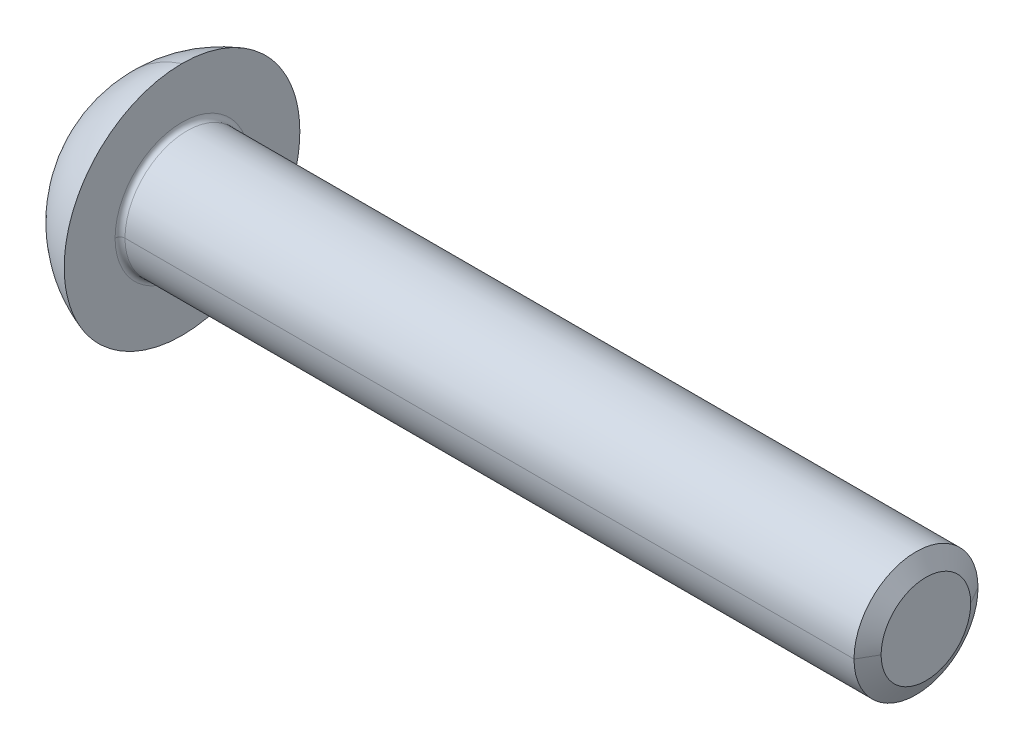
ISO-10303-21;
HEADER;
FILE_DESCRIPTION(('STEP AP214'),'2;1');
FILE_NAME('part.step','',(''),(''),'','','');
FILE_SCHEMA(('AUTOMOTIVE_DESIGN { 1 0 10303 214 1 1 1 1 }'));
ENDSEC;
DATA;
#1=APPLICATION_CONTEXT('core data for automotive mechanical design processes');
#2=APPLICATION_PROTOCOL_DEFINITION('international standard','automotive_design',2000,#1);
#3=PRODUCT_CONTEXT('',#1,'mechanical');
#4=PRODUCT('Part','Part','',(#3));
#5=PRODUCT_RELATED_PRODUCT_CATEGORY('part','',(#4));
#6=PRODUCT_DEFINITION_FORMATION('','',#4);
#7=PRODUCT_DEFINITION_CONTEXT('part definition',#1,'design');
#8=PRODUCT_DEFINITION('design','',#6,#7);
#9=PRODUCT_DEFINITION_SHAPE('','',#8);
#10=(LENGTH_UNIT() NAMED_UNIT(*) SI_UNIT(.MILLI.,.METRE.));
#11=(NAMED_UNIT(*) PLANE_ANGLE_UNIT() SI_UNIT($,.RADIAN.));
#12=(NAMED_UNIT(*) SI_UNIT($,.STERADIAN.) SOLID_ANGLE_UNIT());
#13=UNCERTAINTY_MEASURE_WITH_UNIT(LENGTH_MEASURE(1.E-05),#10,'distance_accuracy_value','');
#14=(GEOMETRIC_REPRESENTATION_CONTEXT(3) GLOBAL_UNCERTAINTY_ASSIGNED_CONTEXT((#13)) GLOBAL_UNIT_ASSIGNED_CONTEXT((#10,
#11,#12)) REPRESENTATION_CONTEXT('',''));
#15=CARTESIAN_POINT('',(0.,0.,0.));
#16=DIRECTION('',(0.,0.,1.));
#17=DIRECTION('',(1.,0.,0.));
#18=AXIS2_PLACEMENT_3D('',#15,#16,#17);
#19=CARTESIAN_POINT('',(0.,2.5,0.));
#20=DIRECTION('',(-1.,0.,0.));
#21=DIRECTION('',(0.,0.,1.));
#22=AXIS2_PLACEMENT_3D('',#19,#20,#21);
#23=PLANE('',#22);
#24=CARTESIAN_POINT('',(0.,0.,0.));
#25=DIRECTION('',(-1.,0.,0.));
#26=DIRECTION('',(0.,0.,1.));
#27=AXIS2_PLACEMENT_3D('',#24,#25,#26);
#28=CIRCLE('',#27,1.80717967697245);
#29=CARTESIAN_POINT('',(0.,0.,1.80717967697245));
#30=VERTEX_POINT('',#29);
#31=CARTESIAN_POINT('',(0.,0.,-1.80717967697245));
#32=VERTEX_POINT('',#31);
#33=EDGE_CURVE('E404',#30,#32,#28,.T.);
#34=ORIENTED_EDGE('',*,*,#33,.F.);
#35=CARTESIAN_POINT('',(0.,0.,0.));
#36=DIRECTION('',(-1.,0.,0.));
#37=DIRECTION('',(0.,0.,1.));
#38=AXIS2_PLACEMENT_3D('',#35,#36,#37);
#39=CIRCLE('',#38,1.80717967697245);
#40=EDGE_CURVE('E11',#32,#30,#39,.T.);
#41=ORIENTED_EDGE('',*,*,#40,.F.);
#42=EDGE_LOOP('',(#34,#41));
#43=FACE_BOUND('',#42,.T.);
#44=ADVANCED_FACE('F16',(#43),#23,.F.);
#45=CARTESIAN_POINT('',(-0.4,0.,0.));
#46=DIRECTION('',(-1.,0.,0.));
#47=DIRECTION('',(0.,0.,1.));
#48=AXIS2_PLACEMENT_3D('',#45,#46,#47);
#49=CONICAL_SURFACE('',#48,2.5,1.0471975511966);
#50=DIRECTION('',(-0.5,0.,-0.866025403784439));
#51=VECTOR('',#50,1.);
#52=CARTESIAN_POINT('',(-0.4,0.,-2.5));
#53=LINE('',#52,#51);
#54=CARTESIAN_POINT('',(-0.4,0.,-2.5));
#55=VERTEX_POINT('',#54);
#56=EDGE_CURVE('E407',#32,#55,#53,.T.);
#57=ORIENTED_EDGE('',*,*,#56,.F.);
#58=ORIENTED_EDGE('',*,*,#40,.T.);
#59=DIRECTION('',(-0.5,0.,0.866025403784439));
#60=VECTOR('',#59,1.);
#61=CARTESIAN_POINT('',(-0.4,0.,2.5));
#62=LINE('',#61,#60);
#63=CARTESIAN_POINT('',(-0.4,0.,2.5));
#64=VERTEX_POINT('',#63);
#65=EDGE_CURVE('E151',#30,#64,#62,.T.);
#66=ORIENTED_EDGE('',*,*,#65,.T.);
#67=CARTESIAN_POINT('',(-0.4,0.,0.));
#68=DIRECTION('',(-1.,0.,0.));
#69=DIRECTION('',(0.,0.,1.));
#70=AXIS2_PLACEMENT_3D('',#67,#68,#69);
#71=CIRCLE('',#70,2.5);
#72=EDGE_CURVE('E436',#55,#64,#71,.T.);
#73=ORIENTED_EDGE('',*,*,#72,.F.);
#74=EDGE_LOOP('',(#57,#58,#66,#73));
#75=FACE_BOUND('',#74,.T.);
#76=ADVANCED_FACE('F283',(#75),#49,.T.);
#77=CARTESIAN_POINT('',(-30.,0.866025403784438,1.5));
#78=DIRECTION('',(0.,0.866025403784439,0.5));
#79=DIRECTION('',(1.,0.,0.));
#80=AXIS2_PLACEMENT_3D('',#77,#78,#79);
#81=PLANE('',#80);
#82=CARTESIAN_POINT('',(-32.7499999999994,1.73205080756891,0.));
#83=CARTESIAN_POINT('',(-32.7408573765465,1.69607486940311,0.062312152753065));
#84=CARTESIAN_POINT('',(-32.7325594420539,1.66004020401431,0.124726024040211));
#85=CARTESIAN_POINT('',(-32.7179832082929,1.58785646888292,0.249751920767876));
#86=CARTESIAN_POINT('',(-32.7117056423067,1.5517073624007,0.312364009843297));
#87=CARTESIAN_POINT('',(-32.7015311863794,1.47949191600483,0.437444832092208));
#88=CARTESIAN_POINT('',(-32.6976233799525,1.44342597090724,0.499912881424221));
#89=CARTESIAN_POINT('',(-32.6923835981542,1.37125271361339,0.624920630004916));
#90=CARTESIAN_POINT('',(-32.6910511776648,1.33514540964502,0.687460315002459));
#91=CARTESIAN_POINT('',(-32.6910511776648,1.26293080170829,0.812539684997543));
#92=CARTESIAN_POINT('',(-32.6923835981542,1.22682349773993,0.875079369995086));
#93=CARTESIAN_POINT('',(-32.6976233799525,1.15465024044607,1.00008711857578));
#94=CARTESIAN_POINT('',(-32.7015311863794,1.11858429534848,1.0625551679078));
#95=CARTESIAN_POINT('',(-32.7117056423067,1.04636884895261,1.18763599015671));
#96=CARTESIAN_POINT('',(-32.7179832082929,1.0102197424704,1.25024807923213));
#97=CARTESIAN_POINT('',(-32.7325594420539,0.938036007339004,1.37527397595979));
#98=CARTESIAN_POINT('',(-32.7408573765465,0.902001341950204,1.43768784724694));
#99=CARTESIAN_POINT('',(-32.7499999999995,0.866025403784401,1.50000000000006));
#100=B_SPLINE_CURVE_WITH_KNOTS('',3,(#82,#83,#84,#85,#86,#87,#88,#89,#90,#91,#92,#93,#94,#95,
#96,#97,#98,#99),.UNSPECIFIED.,.F.,.F.,(4,2,2,2,2,2,2,2,4),(0.,0.217601384094187,
0.435281656650519,0.65195139574377,0.868583683274668,1.08521597080557,1.30188570989882,
1.51956598245515,1.73716736654934),.UNSPECIFIED.);
#101=CARTESIAN_POINT('',(-32.7499999999544,1.73205080756887,0.));
#102=VERTEX_POINT('',#101);
#103=CARTESIAN_POINT('',(-32.7499999999544,0.866025403784438,1.5));
#104=VERTEX_POINT('',#103);
#105=EDGE_CURVE('E305',#102,#104,#100,.T.);
#106=ORIENTED_EDGE('',*,*,#105,.F.);
#107=DIRECTION('',(-1.,0.,0.));
#108=VECTOR('',#107,1.);
#109=CARTESIAN_POINT('',(-30.,1.73205080756887,0.));
#110=LINE('',#109,#108);
#111=CARTESIAN_POINT('',(-31.19,1.73205080756887,0.));
#112=VERTEX_POINT('',#111);
#113=EDGE_CURVE('E126',#112,#102,#110,.T.);
#114=ORIENTED_EDGE('',*,*,#113,.F.);
#115=CARTESIAN_POINT('',(-31.19,0.866025403784438,1.5));
#116=CARTESIAN_POINT('',(-31.1633962054271,0.904741848721342,1.43294115028084));
#117=CARTESIAN_POINT('',(-31.1391436499623,0.943931348509193,1.36506294552507));
#118=CARTESIAN_POINT('',(-31.0968670573699,1.02328638274588,1.22761599439076));
#119=CARTESIAN_POINT('',(-31.0788663456252,1.06345498643256,1.15804193193634));
#120=CARTESIAN_POINT('',(-31.051332234841,1.14308626744336,1.02011650735383));
#121=CARTESIAN_POINT('',(-31.0415234941389,1.18252414183117,0.951808105171623));
#122=CARTESIAN_POINT('',(-31.030439696053,1.2616337168324,0.814786301904315));
#123=CARTESIAN_POINT('',(-31.0291482146729,1.30130481968961,0.746073936163337));
#124=CARTESIAN_POINT('',(-31.0346835519956,1.37373250114362,0.620625512010573));
#125=CARTESIAN_POINT('',(-31.0401665397019,1.40651715971564,0.563840817655034));
#126=CARTESIAN_POINT('',(-31.0566315114364,1.4717787763277,0.450804381898876));
#127=CARTESIAN_POINT('',(-31.0676209046908,1.50425525954172,0.394553462921031));
#128=CARTESIAN_POINT('',(-31.0947517533827,1.56968281351251,0.281229615228669));
#129=CARTESIAN_POINT('',(-31.1110397082616,1.60261828732002,0.2241837012227));
#130=CARTESIAN_POINT('',(-31.1476923326176,1.66782023181351,0.111250620607704));
#131=CARTESIAN_POINT('',(-31.1680452165152,1.70008834563637,0.0553606080020887));
#132=CARTESIAN_POINT('',(-31.19,1.73205080756888,0.));
#133=B_SPLINE_CURVE_WITH_KNOTS('',3,(#115,#116,#117,#118,#119,#120,#121,#122,#123,#124,#125,
#126,#127,#128,#129,#130,#131,#132),.UNSPECIFIED.,.F.,.F.,(4,2,2,2,2,2,2,2,4),(0.,
0.245789252252995,0.492485924281899,0.730512718711125,0.96808038691347,1.16522925941244,
1.36264412377986,1.56606184012896,1.76889812588192),.UNSPECIFIED.);
#134=CARTESIAN_POINT('',(-31.19,0.866025403784438,1.5));
#135=VERTEX_POINT('',#134);
#136=EDGE_CURVE('E218',#135,#112,#133,.T.);
#137=ORIENTED_EDGE('',*,*,#136,.F.);
#138=DIRECTION('',(-1.,0.,0.));
#139=VECTOR('',#138,1.);
#140=CARTESIAN_POINT('',(-30.,0.866025403784438,1.5));
#141=LINE('',#140,#139);
#142=EDGE_CURVE('E33',#135,#104,#141,.T.);
#143=ORIENTED_EDGE('',*,*,#142,.T.);
#144=EDGE_LOOP('',(#106,#114,#137,#143));
#145=FACE_BOUND('',#144,.T.);
#146=ADVANCED_FACE('F257',(#145),#81,.F.);
#147=CARTESIAN_POINT('',(-30.,-0.86602540378444,1.5));
#148=DIRECTION('',(0.,0.,1.));
#149=DIRECTION('',(0.,-1.,0.));
#150=AXIS2_PLACEMENT_3D('',#147,#148,#149);
#151=PLANE('',#150);
#152=CARTESIAN_POINT('',(-32.7499999999994,0.86602540378451,1.5));
#153=CARTESIAN_POINT('',(-32.7408573765465,0.794073527452903,1.5));
#154=CARTESIAN_POINT('',(-32.7325594420539,0.722004196675303,1.5));
#155=CARTESIAN_POINT('',(-32.7179832082929,0.577636726412519,1.5));
#156=CARTESIAN_POINT('',(-32.7117056423067,0.505338513448082,1.5));
#157=CARTESIAN_POINT('',(-32.7015311863794,0.360907620656345,1.5));
#158=CARTESIAN_POINT('',(-32.6976233799525,0.288775730461167,1.5));
#159=CARTESIAN_POINT('',(-32.6923835981542,0.144429215873461,1.5));
#160=CARTESIAN_POINT('',(-32.6910511776648,0.07221460793673,1.5));
#161=CARTESIAN_POINT('',(-32.6910511776648,-0.0722146079367318,1.5));
#162=CARTESIAN_POINT('',(-32.6923835981542,-0.144429215873463,1.5));
#163=CARTESIAN_POINT('',(-32.6976233799525,-0.288775730461169,1.5));
#164=CARTESIAN_POINT('',(-32.7015311863794,-0.360907620656347,1.5));
#165=CARTESIAN_POINT('',(-32.7117056423067,-0.505338513448084,1.5));
#166=CARTESIAN_POINT('',(-32.7179832082929,-0.577636726412522,1.5));
#167=CARTESIAN_POINT('',(-32.7325594420539,-0.722004196675305,1.5));
#168=CARTESIAN_POINT('',(-32.7408573765465,-0.794073527452905,1.5));
#169=CARTESIAN_POINT('',(-32.7499999999995,-0.866025403784512,1.5));
#170=B_SPLINE_CURVE_WITH_KNOTS('',3,(#152,#153,#154,#155,#156,#157,#158,#159,#160,#161,#162,
#163,#164,#165,#166,#167,#168,#169),.UNSPECIFIED.,.F.,.F.,(4,2,2,2,2,2,2,2,4),(0.,
0.217601384094187,0.435281656650519,0.651951395743769,0.868583683274666,1.08521597080556,
1.30188570989881,1.51956598245515,1.73716736654933),.UNSPECIFIED.);
#171=CARTESIAN_POINT('',(-32.7499999999544,-0.866025403784439,1.5));
#172=VERTEX_POINT('',#171);
#173=EDGE_CURVE('E337',#104,#172,#170,.T.);
#174=ORIENTED_EDGE('',*,*,#173,.F.);
#175=ORIENTED_EDGE('',*,*,#142,.F.);
#176=CARTESIAN_POINT('',(-31.0305702305035,0.,1.5));
#177=CARTESIAN_POINT('',(-31.0305664713556,0.0324956202581746,1.5));
#178=CARTESIAN_POINT('',(-31.0312961517598,0.0649865884678622,1.5));
#179=CARTESIAN_POINT('',(-31.0341887430939,0.129898131503973,1.5));
#180=CARTESIAN_POINT('',(-31.0363513564149,0.162318719545317,1.5));
#181=CARTESIAN_POINT('',(-31.0449274501895,0.259277414833573,1.5));
#182=CARTESIAN_POINT('',(-31.0534294414627,0.323639525331351,1.5));
#183=CARTESIAN_POINT('',(-31.0752890694466,0.450851269984477,1.5));
#184=CARTESIAN_POINT('',(-31.0885979809674,0.513709560960378,1.5));
#185=CARTESIAN_POINT('',(-31.1193139507207,0.638417113178647,1.5));
#186=CARTESIAN_POINT('',(-31.1367216167382,0.700266223318475,1.5));
#187=CARTESIAN_POINT('',(-31.1612297231665,0.779060989886268,1.5));
#188=CARTESIAN_POINT('',(-31.1668015871795,0.796496763690585,1.5));
#189=CARTESIAN_POINT('',(-31.1782086748573,0.831310333336132,1.5));
#190=CARTESIAN_POINT('',(-31.1840442731198,0.848688006494102,1.5));
#191=CARTESIAN_POINT('',(-31.19,0.866025403784437,1.5));
#192=B_SPLINE_CURVE_WITH_KNOTS('',3,(#176,#177,#178,#179,#180,#181,#182,#183,#184,#185,#186,
#187,#188,#189,#190,#191),.UNSPECIFIED.,.F.,.F.,(4,2,2,2,2,2,2,4),(0.,0.0974699410715187,
0.194919644742644,0.38943916948007,0.582039881126868,0.774669170638759,0.829581611706491,
0.884574662778733),.UNSPECIFIED.);
#193=CARTESIAN_POINT('',(-31.0305702305035,0.,1.5));
#194=VERTEX_POINT('',#193);
#195=EDGE_CURVE('E226',#194,#135,#192,.T.);
#196=ORIENTED_EDGE('',*,*,#195,.F.);
#197=CARTESIAN_POINT('',(-31.19,-0.866025403784439,1.5));
#198=CARTESIAN_POINT('',(-31.1660035651437,-0.796154723158162,1.5));
#199=CARTESIAN_POINT('',(-31.1439184572691,-0.725546847613857,1.5));
#200=CARTESIAN_POINT('',(-31.1048898922759,-0.583468448677839,1.5));
#201=CARTESIAN_POINT('',(-31.0879115670399,-0.51200740780449,1.5));
#202=CARTESIAN_POINT('',(-31.0600252326393,-0.367739609192074,1.5));
#203=CARTESIAN_POINT('',(-31.0491269176568,-0.294930892523075,1.5));
#204=CARTESIAN_POINT('',(-31.0380709998005,-0.184943820410723,1.5));
#205=CARTESIAN_POINT('',(-31.035267193967,-0.148019785862493,1.5));
#206=CARTESIAN_POINT('',(-31.0315133289738,-0.0740662778470025,1.5));
#207=CARTESIAN_POINT('',(-31.0305638591163,-0.0370367746049553,1.5));
#208=CARTESIAN_POINT('',(-31.0305702305035,0.,1.5));
#209=B_SPLINE_CURVE_WITH_KNOTS('',3,(#197,#198,#199,#200,#201,#202,#203,#204,#205,#206,#207,
#208),.UNSPECIFIED.,.F.,.F.,(4,2,2,2,2,4),(0.,0.221713877463993,0.441877651069902,
0.662391465543781,0.773440894064292,0.884525608009934),.UNSPECIFIED.);
#210=CARTESIAN_POINT('',(-31.19,-0.86602540378444,1.5));
#211=VERTEX_POINT('',#210);
#212=EDGE_CURVE('E272',#211,#194,#209,.T.);
#213=ORIENTED_EDGE('',*,*,#212,.F.);
#214=DIRECTION('',(-1.,0.,0.));
#215=VECTOR('',#214,1.);
#216=CARTESIAN_POINT('',(-30.,-0.86602540378444,1.5));
#217=LINE('',#216,#215);
#218=EDGE_CURVE('E159',#211,#172,#217,.T.);
#219=ORIENTED_EDGE('',*,*,#218,.T.);
#220=EDGE_LOOP('',(#174,#175,#196,#213,#219));
#221=FACE_BOUND('',#220,.T.);
#222=ADVANCED_FACE('F213',(#221),#151,.F.);
#223=CARTESIAN_POINT('',(-30.,-1.73205080756888,0.));
#224=DIRECTION('',(0.,-0.866025403784439,0.5));
#225=DIRECTION('',(-1.,0.,0.));
#226=AXIS2_PLACEMENT_3D('',#223,#224,#225);
#227=PLANE('',#226);
#228=CARTESIAN_POINT('',(-32.7499999999994,-0.866025403784405,1.50000000000006));
#229=CARTESIAN_POINT('',(-32.7408573765465,-0.902001341950208,1.43768784724694));
#230=CARTESIAN_POINT('',(-32.7325594420539,-0.938036007339008,1.37527397595979));
#231=CARTESIAN_POINT('',(-32.7179832082929,-1.0102197424704,1.25024807923212));
#232=CARTESIAN_POINT('',(-32.7117056423067,-1.04636884895262,1.1876359901567));
#233=CARTESIAN_POINT('',(-32.7015311863794,-1.11858429534849,1.06255516790779));
#234=CARTESIAN_POINT('',(-32.6976233799525,-1.15465024044608,1.00008711857578));
#235=CARTESIAN_POINT('',(-32.6923835981542,-1.22682349773993,0.875079369995084));
#236=CARTESIAN_POINT('',(-32.6910511776648,-1.2629308017083,0.812539684997542));
#237=CARTESIAN_POINT('',(-32.6910511776648,-1.33514540964503,0.687460315002457));
#238=CARTESIAN_POINT('',(-32.6923835981542,-1.37125271361339,0.624920630004915));
#239=CARTESIAN_POINT('',(-32.6976233799525,-1.44342597090725,0.499912881424219));
#240=CARTESIAN_POINT('',(-32.7015311863794,-1.47949191600483,0.437444832092205));
#241=CARTESIAN_POINT('',(-32.7117056423067,-1.5517073624007,0.312364009843294));
#242=CARTESIAN_POINT('',(-32.7179832082929,-1.58785646888292,0.249751920767874));
#243=CARTESIAN_POINT('',(-32.7325594420539,-1.66004020401431,0.124726024040209));
#244=CARTESIAN_POINT('',(-32.7408573765465,-1.69607486940311,0.0623121527530633));
#245=CARTESIAN_POINT('',(-32.7499999999995,-1.73205080756892,0.));
#246=B_SPLINE_CURVE_WITH_KNOTS('',3,(#228,#229,#230,#231,#232,#233,#234,#235,#236,#237,#238,
#239,#240,#241,#242,#243,#244,#245),.UNSPECIFIED.,.F.,.F.,(4,2,2,2,2,2,2,2,4),(0.,
0.217601384094187,0.43528165665052,0.65195139574377,0.868583683274668,1.08521597080557,
1.30188570989882,1.51956598245515,1.73716736654934),.UNSPECIFIED.);
#247=CARTESIAN_POINT('',(-32.7499999999544,-1.73205080756888,0.));
#248=VERTEX_POINT('',#247);
#249=EDGE_CURVE('E242',#172,#248,#246,.T.);
#250=ORIENTED_EDGE('',*,*,#249,.F.);
#251=ORIENTED_EDGE('',*,*,#218,.F.);
#252=CARTESIAN_POINT('',(-31.19,-1.73205080756888,0.));
#253=CARTESIAN_POINT('',(-31.1633962054271,-1.69333436263198,0.0670588497191607));
#254=CARTESIAN_POINT('',(-31.1391436499623,-1.65414486284413,0.134937054474927));
#255=CARTESIAN_POINT('',(-31.0968670573699,-1.57478982860744,0.272384005609239));
#256=CARTESIAN_POINT('',(-31.0788663456252,-1.53462122492076,0.341958068063664));
#257=CARTESIAN_POINT('',(-31.051332234841,-1.45498994390995,0.479883492646174));
#258=CARTESIAN_POINT('',(-31.0415234941389,-1.41555206952214,0.548191894828379));
#259=CARTESIAN_POINT('',(-31.030439696053,-1.33644249452092,0.685213698095688));
#260=CARTESIAN_POINT('',(-31.0291482146729,-1.29677139166371,0.753926063836666));
#261=CARTESIAN_POINT('',(-31.0346835519956,-1.22434371020969,0.879374487989431));
#262=CARTESIAN_POINT('',(-31.0401665397019,-1.19155905163767,0.936159182344969));
#263=CARTESIAN_POINT('',(-31.0566315114364,-1.12629743502562,1.04919561810113));
#264=CARTESIAN_POINT('',(-31.0676209046908,-1.0938209518116,1.10544653707897));
#265=CARTESIAN_POINT('',(-31.0947517533827,-1.02839339784081,1.21877038477133));
#266=CARTESIAN_POINT('',(-31.1110397082616,-0.995457924033292,1.2758162987773));
#267=CARTESIAN_POINT('',(-31.1476923326176,-0.930255979539811,1.3887493793923));
#268=CARTESIAN_POINT('',(-31.1680452165152,-0.897987865716947,1.44463939199791));
#269=CARTESIAN_POINT('',(-31.19,-0.866025403784441,1.5));
#270=B_SPLINE_CURVE_WITH_KNOTS('',3,(#252,#253,#254,#255,#256,#257,#258,#259,#260,#261,#262,
#263,#264,#265,#266,#267,#268,#269),.UNSPECIFIED.,.F.,.F.,(4,2,2,2,2,2,2,2,4),(0.,
0.245789252252996,0.492485924281902,0.730512718711128,0.968080386913474,1.16522925941245,
1.36264412377987,1.56606184012896,1.76889812588192),.UNSPECIFIED.);
#271=CARTESIAN_POINT('',(-31.19,-1.73205080756888,0.));
#272=VERTEX_POINT('',#271);
#273=EDGE_CURVE('E135',#272,#211,#270,.T.);
#274=ORIENTED_EDGE('',*,*,#273,.F.);
#275=DIRECTION('',(-1.,0.,0.));
#276=VECTOR('',#275,1.);
#277=CARTESIAN_POINT('',(-30.,-1.73205080756888,0.));
#278=LINE('',#277,#276);
#279=EDGE_CURVE('E125',#272,#248,#278,.T.);
#280=ORIENTED_EDGE('',*,*,#279,.T.);
#281=EDGE_LOOP('',(#250,#251,#274,#280));
#282=FACE_BOUND('',#281,.T.);
#283=ADVANCED_FACE('F255',(#282),#227,.F.);
#284=CARTESIAN_POINT('',(-30.,-0.86602540378444,-1.5));
#285=DIRECTION('',(0.,-0.866025403784439,-0.5));
#286=DIRECTION('',(0.,0.5,-0.866025403784439));
#287=AXIS2_PLACEMENT_3D('',#284,#285,#286);
#288=PLANE('',#287);
#289=CARTESIAN_POINT('',(-32.7499999999994,-1.73205080756891,0.));
#290=CARTESIAN_POINT('',(-32.7408573765467,-1.6960748694031,-0.0623121527530874));
#291=CARTESIAN_POINT('',(-32.7325594420541,-1.6600402040143,-0.124726024040233));
#292=CARTESIAN_POINT('',(-32.7179832082929,-1.58785646888291,-0.249751920767887));
#293=CARTESIAN_POINT('',(-32.7117056423066,-1.5517073624007,-0.312364009843296));
#294=CARTESIAN_POINT('',(-32.7015311863793,-1.47949191600483,-0.437444832092202));
#295=CARTESIAN_POINT('',(-32.6976233799525,-1.44342597090724,-0.499912881424222));
#296=CARTESIAN_POINT('',(-32.6923835981542,-1.37125271361339,-0.624920630004922));
#297=CARTESIAN_POINT('',(-32.6910511776648,-1.33514540964502,-0.687460315002462));
#298=CARTESIAN_POINT('',(-32.6910511776647,-1.26293080170829,-0.812539684997545));
#299=CARTESIAN_POINT('',(-32.6923835981542,-1.22682349773993,-0.875079369995088));
#300=CARTESIAN_POINT('',(-32.6976233799525,-1.15465024044607,-1.00008711857578));
#301=CARTESIAN_POINT('',(-32.7015311863794,-1.11858429534848,-1.0625551679078));
#302=CARTESIAN_POINT('',(-32.7117056423067,-1.04636884895262,-1.1876359901567));
#303=CARTESIAN_POINT('',(-32.7179832082929,-1.0102197424704,-1.25024807923212));
#304=CARTESIAN_POINT('',(-32.732559442054,-0.938036007339012,-1.37527397595978));
#305=CARTESIAN_POINT('',(-32.7408573765466,-0.902001341950211,-1.43768784724693));
#306=CARTESIAN_POINT('',(-32.7499999999995,-0.866025403784403,-1.50000000000007));
#307=B_SPLINE_CURVE_WITH_KNOTS('',3,(#289,#290,#291,#292,#293,#294,#295,#296,#297,#298,#299,
#300,#301,#302,#303,#304,#305,#306),.UNSPECIFIED.,.F.,.F.,(4,2,2,2,2,2,2,2,4),(0.,
0.21760138409419,0.435281656650518,0.651951395743765,0.868583683274664,1.08521597080556,
1.30188570989881,1.51956598245514,1.73716736654933),.UNSPECIFIED.);
#308=CARTESIAN_POINT('',(-32.7499999999544,-0.86602540378444,-1.5));
#309=VERTEX_POINT('',#308);
#310=EDGE_CURVE('E234',#248,#309,#307,.T.);
#311=ORIENTED_EDGE('',*,*,#310,.F.);
#312=ORIENTED_EDGE('',*,*,#279,.F.);
#313=CARTESIAN_POINT('',(-31.19,-0.86602540378444,-1.5));
#314=CARTESIAN_POINT('',(-31.1633962054271,-0.904741848721344,-1.43294115028084));
#315=CARTESIAN_POINT('',(-31.1391436499623,-0.943931348509194,-1.36506294552507));
#316=CARTESIAN_POINT('',(-31.0968670573699,-1.02328638274588,-1.22761599439076));
#317=CARTESIAN_POINT('',(-31.0788663456252,-1.06345498643256,-1.15804193193634));
#318=CARTESIAN_POINT('',(-31.051332234841,-1.14308626744337,-1.02011650735383));
#319=CARTESIAN_POINT('',(-31.0415234941389,-1.18252414183118,-0.951808105171621));
#320=CARTESIAN_POINT('',(-31.030439696053,-1.2616337168324,-0.814786301904312));
#321=CARTESIAN_POINT('',(-31.0291482146729,-1.30130481968961,-0.746073936163334));
#322=CARTESIAN_POINT('',(-31.0346835519956,-1.37373250114363,-0.62062551201057));
#323=CARTESIAN_POINT('',(-31.0401665397019,-1.40651715971565,-0.563840817655032));
#324=CARTESIAN_POINT('',(-31.0566315114364,-1.4717787763277,-0.450804381898873));
#325=CARTESIAN_POINT('',(-31.0676209046908,-1.50425525954172,-0.394553462921028));
#326=CARTESIAN_POINT('',(-31.0947517533827,-1.56968281351251,-0.281229615228667));
#327=CARTESIAN_POINT('',(-31.1110397082616,-1.60261828732003,-0.224183701222698));
#328=CARTESIAN_POINT('',(-31.1476923326176,-1.66782023181351,-0.111250620607702));
#329=CARTESIAN_POINT('',(-31.1680452165152,-1.70008834563637,-0.0553606080020868));
#330=CARTESIAN_POINT('',(-31.19,-1.73205080756888,0.));
#331=B_SPLINE_CURVE_WITH_KNOTS('',3,(#313,#314,#315,#316,#317,#318,#319,#320,#321,#322,#323,
#324,#325,#326,#327,#328,#329,#330),.UNSPECIFIED.,.F.,.F.,(4,2,2,2,2,2,2,2,4),(0.,
0.245789252252995,0.492485924281901,0.730512718711128,0.968080386913473,1.16522925941245,
1.36264412377986,1.56606184012896,1.76889812588192),.UNSPECIFIED.);
#332=CARTESIAN_POINT('',(-31.19,-0.86602540378444,-1.5));
#333=VERTEX_POINT('',#332);
#334=EDGE_CURVE('E129',#333,#272,#331,.T.);
#335=ORIENTED_EDGE('',*,*,#334,.F.);
#336=DIRECTION('',(-1.,0.,0.));
#337=VECTOR('',#336,1.);
#338=CARTESIAN_POINT('',(-30.,-0.86602540378444,-1.5));
#339=LINE('',#338,#337);
#340=EDGE_CURVE('E113',#333,#309,#339,.T.);
#341=ORIENTED_EDGE('',*,*,#340,.T.);
#342=EDGE_LOOP('',(#311,#312,#335,#341));
#343=FACE_BOUND('',#342,.T.);
#344=ADVANCED_FACE('F130',(#343),#288,.F.);
#345=CARTESIAN_POINT('',(-30.,0.866025403784438,-1.5));
#346=DIRECTION('',(0.,0.,-1.));
#347=DIRECTION('',(0.,-1.,0.));
#348=AXIS2_PLACEMENT_3D('',#345,#346,#347);
#349=PLANE('',#348);
#350=CARTESIAN_POINT('',(-32.7499999999994,-0.866025403784511,-1.5));
#351=CARTESIAN_POINT('',(-32.7408573765466,-0.794073527452897,-1.5));
#352=CARTESIAN_POINT('',(-32.732559442054,-0.722004196675296,-1.5));
#353=CARTESIAN_POINT('',(-32.7179832082929,-0.577636726412513,-1.5));
#354=CARTESIAN_POINT('',(-32.7117056423067,-0.505338513448076,-1.5));
#355=CARTESIAN_POINT('',(-32.7015311863794,-0.360907620656338,-1.5));
#356=CARTESIAN_POINT('',(-32.6976233799526,-0.288775730461158,-1.5));
#357=CARTESIAN_POINT('',(-32.6923835981542,-0.144429215873453,-1.5));
#358=CARTESIAN_POINT('',(-32.6910511776646,-0.0722146079367258,-1.5));
#359=CARTESIAN_POINT('',(-32.6910511776646,0.0722146079367293,-1.5));
#360=CARTESIAN_POINT('',(-32.6923835981542,0.144429215873457,-1.5));
#361=CARTESIAN_POINT('',(-32.6976233799526,0.288775730461162,-1.5));
#362=CARTESIAN_POINT('',(-32.7015311863795,0.360907620656341,-1.5));
#363=CARTESIAN_POINT('',(-32.7117056423067,0.505338513448079,-1.5));
#364=CARTESIAN_POINT('',(-32.7179832082929,0.577636726412516,-1.5));
#365=CARTESIAN_POINT('',(-32.732559442054,0.722004196675299,-1.5));
#366=CARTESIAN_POINT('',(-32.7408573765466,0.7940735274529,-1.5));
#367=CARTESIAN_POINT('',(-32.7499999999995,0.866025403784513,-1.5));
#368=B_SPLINE_CURVE_WITH_KNOTS('',3,(#350,#351,#352,#353,#354,#355,#356,#357,#358,#359,#360,
#361,#362,#363,#364,#365,#366,#367),.UNSPECIFIED.,.F.,.F.,(4,2,2,2,2,2,2,2,4),(0.,
0.217601384094185,0.435281656650524,0.651951395743774,0.868583683274666,1.08521597080556,
1.30188570989881,1.51956598245515,1.73716736654933),.UNSPECIFIED.);
#369=CARTESIAN_POINT('',(-32.7499999999544,0.866025403784438,-1.5));
#370=VERTEX_POINT('',#369);
#371=EDGE_CURVE('E119',#309,#370,#368,.T.);
#372=ORIENTED_EDGE('',*,*,#371,.F.);
#373=ORIENTED_EDGE('',*,*,#340,.F.);
#374=CARTESIAN_POINT('',(-31.0305702305035,0.,-1.5));
#375=CARTESIAN_POINT('',(-31.0305664713556,-0.0324956202581745,-1.5));
#376=CARTESIAN_POINT('',(-31.0312961517598,-0.0649865884678624,-1.5));
#377=CARTESIAN_POINT('',(-31.0341887430939,-0.129898131503974,-1.5));
#378=CARTESIAN_POINT('',(-31.0363513564149,-0.162318719545317,-1.5));
#379=CARTESIAN_POINT('',(-31.0449274501895,-0.259277414833574,-1.5));
#380=CARTESIAN_POINT('',(-31.0534294414627,-0.323639525331351,-1.5));
#381=CARTESIAN_POINT('',(-31.0752890694466,-0.450851269984477,-1.5));
#382=CARTESIAN_POINT('',(-31.0885979809674,-0.513709560960379,-1.5));
#383=CARTESIAN_POINT('',(-31.1193139507207,-0.638417113178647,-1.5));
#384=CARTESIAN_POINT('',(-31.1367216167382,-0.700266223318474,-1.5));
#385=CARTESIAN_POINT('',(-31.1612297231665,-0.779060989886268,-1.5));
#386=CARTESIAN_POINT('',(-31.1668015871795,-0.796496763690585,-1.5));
#387=CARTESIAN_POINT('',(-31.1782086748573,-0.831310333336134,-1.5));
#388=CARTESIAN_POINT('',(-31.1840442731198,-0.848688006494105,-1.5));
#389=CARTESIAN_POINT('',(-31.19,-0.86602540378444,-1.5));
#390=B_SPLINE_CURVE_WITH_KNOTS('',3,(#374,#375,#376,#377,#378,#379,#380,#381,#382,#383,#384,
#385,#386,#387,#388,#389),.UNSPECIFIED.,.F.,.F.,(4,2,2,2,2,2,2,4),(0.,0.0974699410715192,
0.194919644742645,0.38943916948007,0.582039881126868,0.774669170638759,0.829581611706493,
0.884574662778737),.UNSPECIFIED.);
#391=CARTESIAN_POINT('',(-31.0305702305035,0.,-1.5));
#392=VERTEX_POINT('',#391);
#393=EDGE_CURVE('E21',#392,#333,#390,.T.);
#394=ORIENTED_EDGE('',*,*,#393,.F.);
#395=CARTESIAN_POINT('',(-31.19,0.866025403784438,-1.5));
#396=CARTESIAN_POINT('',(-31.1660035651437,0.796154723158161,-1.5));
#397=CARTESIAN_POINT('',(-31.1439184572691,0.725546847613856,-1.5));
#398=CARTESIAN_POINT('',(-31.1048898922759,0.583468448677838,-1.5));
#399=CARTESIAN_POINT('',(-31.0879115670399,0.512007407804489,-1.5));
#400=CARTESIAN_POINT('',(-31.0600252326393,0.367739609192073,-1.5));
#401=CARTESIAN_POINT('',(-31.0491269176568,0.294930892523074,-1.5));
#402=CARTESIAN_POINT('',(-31.0380709998005,0.184943820410722,-1.5));
#403=CARTESIAN_POINT('',(-31.035267193967,0.148019785862491,-1.5));
#404=CARTESIAN_POINT('',(-31.0315133289738,0.0740662778470012,-1.5));
#405=CARTESIAN_POINT('',(-31.0305638591163,0.0370367746049541,-1.5));
#406=CARTESIAN_POINT('',(-31.0305702305035,0.,-1.5));
#407=B_SPLINE_CURVE_WITH_KNOTS('',3,(#395,#396,#397,#398,#399,#400,#401,#402,#403,#404,#405,
#406),.UNSPECIFIED.,.F.,.F.,(4,2,2,2,2,4),(0.,0.221713877463992,0.441877651069901,
0.66239146554378,0.773440894064292,0.884525608009933),.UNSPECIFIED.);
#408=CARTESIAN_POINT('',(-31.19,0.866025403784438,-1.5));
#409=VERTEX_POINT('',#408);
#410=EDGE_CURVE('E105',#409,#392,#407,.T.);
#411=ORIENTED_EDGE('',*,*,#410,.F.);
#412=DIRECTION('',(-1.,0.,0.));
#413=VECTOR('',#412,1.);
#414=CARTESIAN_POINT('',(-30.,0.866025403784438,-1.5));
#415=LINE('',#414,#413);
#416=EDGE_CURVE('E48',#409,#370,#415,.T.);
#417=ORIENTED_EDGE('',*,*,#416,.T.);
#418=EDGE_LOOP('',(#372,#373,#394,#411,#417));
#419=FACE_BOUND('',#418,.T.);
#420=ADVANCED_FACE('F115',(#419),#349,.F.);
#421=CARTESIAN_POINT('',(-30.,1.73205080756887,0.));
#422=DIRECTION('',(0.,0.866025403784439,-0.5));
#423=DIRECTION('',(-1.,0.,0.));
#424=AXIS2_PLACEMENT_3D('',#421,#422,#423);
#425=PLANE('',#424);
#426=CARTESIAN_POINT('',(-32.7499999999994,0.866025403784401,-1.50000000000006));
#427=CARTESIAN_POINT('',(-32.7408573765466,0.902001341950208,-1.43768784724693));
#428=CARTESIAN_POINT('',(-32.732559442054,0.938036007339008,-1.37527397595978));
#429=CARTESIAN_POINT('',(-32.7179832082929,1.0102197424704,-1.25024807923212));
#430=CARTESIAN_POINT('',(-32.7117056423067,1.04636884895262,-1.1876359901567));
#431=CARTESIAN_POINT('',(-32.7015311863795,1.11858429534849,-1.06255516790779));
#432=CARTESIAN_POINT('',(-32.6976233799526,1.15465024044608,-1.00008711857577));
#433=CARTESIAN_POINT('',(-32.6923835981542,1.22682349773993,-0.875079369995077));
#434=CARTESIAN_POINT('',(-32.6910511776646,1.26293080170829,-0.812539684997538));
#435=CARTESIAN_POINT('',(-32.6910511776646,1.33514540964502,-0.687460315002459));
#436=CARTESIAN_POINT('',(-32.6923835981542,1.37125271361338,-0.62492063000492));
#437=CARTESIAN_POINT('',(-32.6976233799526,1.44342597090724,-0.499912881424226));
#438=CARTESIAN_POINT('',(-32.7015311863795,1.47949191600483,-0.437444832092211));
#439=CARTESIAN_POINT('',(-32.7117056423068,1.5517073624007,-0.3123640098433));
#440=CARTESIAN_POINT('',(-32.7179832082929,1.58785646888291,-0.24975192076788));
#441=CARTESIAN_POINT('',(-32.732559442054,1.66004020401431,-0.124726024040215));
#442=CARTESIAN_POINT('',(-32.7408573765466,1.69607486940311,-0.0623121527530692));
#443=CARTESIAN_POINT('',(-32.7499999999995,1.73205080756891,0.));
#444=B_SPLINE_CURVE_WITH_KNOTS('',3,(#426,#427,#428,#429,#430,#431,#432,#433,#434,#435,#436,
#437,#438,#439,#440,#441,#442,#443),.UNSPECIFIED.,.F.,.F.,(4,2,2,2,2,2,2,2,4),(0.,
0.217601384094185,0.435281656650524,0.651951395743773,0.868583683274665,1.08521597080556,
1.30188570989881,1.51956598245515,1.73716736654933),.UNSPECIFIED.);
#445=EDGE_CURVE('E296',#370,#102,#444,.T.);
#446=ORIENTED_EDGE('',*,*,#445,.F.);
#447=ORIENTED_EDGE('',*,*,#416,.F.);
#448=CARTESIAN_POINT('',(-31.19,1.73205080756887,0.));
#449=CARTESIAN_POINT('',(-31.1633962054271,1.69333436263197,-0.0670588497191605));
#450=CARTESIAN_POINT('',(-31.1391436499623,1.65414486284412,-0.134937054474927));
#451=CARTESIAN_POINT('',(-31.0968670573699,1.57478982860743,-0.272384005609238));
#452=CARTESIAN_POINT('',(-31.0788663456252,1.53462122492076,-0.341958068063662));
#453=CARTESIAN_POINT('',(-31.051332234841,1.45498994390995,-0.479883492646172));
#454=CARTESIAN_POINT('',(-31.0415234941389,1.41555206952214,-0.548191894828376));
#455=CARTESIAN_POINT('',(-31.030439696053,1.33644249452091,-0.685213698095685));
#456=CARTESIAN_POINT('',(-31.0291482146729,1.2967713916637,-0.753926063836663));
#457=CARTESIAN_POINT('',(-31.0346835519956,1.22434371020969,-0.879374487989427));
#458=CARTESIAN_POINT('',(-31.0401665397019,1.19155905163767,-0.936159182344966));
#459=CARTESIAN_POINT('',(-31.0566315114364,1.12629743502562,-1.04919561810112));
#460=CARTESIAN_POINT('',(-31.0676209046908,1.09382095181159,-1.10544653707897));
#461=CARTESIAN_POINT('',(-31.0947517533827,1.0283933978408,-1.21877038477133));
#462=CARTESIAN_POINT('',(-31.1110397082616,0.995457924033289,-1.2758162987773));
#463=CARTESIAN_POINT('',(-31.1476923326176,0.930255979539807,-1.3887493793923));
#464=CARTESIAN_POINT('',(-31.1680452165152,0.897987865716944,-1.44463939199791));
#465=CARTESIAN_POINT('',(-31.19,0.866025403784437,-1.5));
#466=B_SPLINE_CURVE_WITH_KNOTS('',3,(#448,#449,#450,#451,#452,#453,#454,#455,#456,#457,#458,
#459,#460,#461,#462,#463,#464,#465),.UNSPECIFIED.,.F.,.F.,(4,2,2,2,2,2,2,2,4),(0.,
0.245789252252994,0.492485924281899,0.730512718711125,0.96808038691347,1.16522925941245,
1.36264412377986,1.56606184012896,1.76889812588192),.UNSPECIFIED.);
#467=EDGE_CURVE('E197',#112,#409,#466,.T.);
#468=ORIENTED_EDGE('',*,*,#467,.F.);
#469=ORIENTED_EDGE('',*,*,#113,.T.);
#470=EDGE_LOOP('',(#446,#447,#468,#469));
#471=FACE_BOUND('',#470,.T.);
#472=ADVANCED_FACE('F212',(#471),#425,.F.);
#473=CARTESIAN_POINT('',(-31.19,0.,0.));
#474=DIRECTION('',(-1.,0.,0.));
#475=DIRECTION('',(0.,0.,1.));
#476=AXIS2_PLACEMENT_3D('',#473,#474,#475);
#477=CONICAL_SURFACE('',#476,1.73205080756887,0.9688167751957);
#478=DIRECTION('',(-0.566275160453803,0.,-0.824216259638828));
#479=VECTOR('',#478,1.);
#480=CARTESIAN_POINT('',(-31.19,0.,-1.73205080756887));
#481=LINE('',#480,#479);
#482=CARTESIAN_POINT('',(-30.,0.,0.));
#483=VERTEX_POINT('',#482);
#484=EDGE_CURVE('E137',#483,#392,#481,.T.);
#485=ORIENTED_EDGE('',*,*,#484,.F.);
#486=DIRECTION('',(-0.566275160453803,0.,0.824216259638828));
#487=VECTOR('',#486,1.);
#488=CARTESIAN_POINT('',(-31.19,0.,1.73205080756887));
#489=LINE('',#488,#487);
#490=EDGE_CURVE('E143',#483,#194,#489,.T.);
#491=ORIENTED_EDGE('',*,*,#490,.T.);
#492=ORIENTED_EDGE('',*,*,#195,.T.);
#493=ORIENTED_EDGE('',*,*,#136,.T.);
#494=ORIENTED_EDGE('',*,*,#467,.T.);
#495=ORIENTED_EDGE('',*,*,#410,.T.);
#496=EDGE_LOOP('',(#485,#491,#492,#493,#494,#495));
#497=FACE_BOUND('',#496,.T.);
#498=ADVANCED_FACE('F207',(#497),#477,.F.);
#499=CARTESIAN_POINT('',(-1032.31,0.,0.));
#500=DIRECTION('',(-1.,0.,0.));
#501=DIRECTION('',(0.,-1.,0.));
#502=AXIS2_PLACEMENT_3D('',#499,#500,#501);
#503=CONICAL_SURFACE('',#502,3936.47910811106,1.32202446504011);
#504=ORIENTED_EDGE('',*,*,#310,.T.);
#505=CARTESIAN_POINT('',(-32.75,0.,0.));
#506=DIRECTION('',(-1.,0.,0.));
#507=DIRECTION('',(0.,0.,-1.));
#508=AXIS2_PLACEMENT_3D('',#505,#506,#507);
#509=CIRCLE('',#508,1.73205080756887);
#510=EDGE_CURVE('E169',#309,#248,#509,.T.);
#511=ORIENTED_EDGE('',*,*,#510,.T.);
#512=EDGE_LOOP('',(#504,#511));
#513=FACE_BOUND('',#512,.T.);
#514=ADVANCED_FACE('F211',(#513),#503,.F.);
#515=CARTESIAN_POINT('',(-1032.31,0.,0.));
#516=DIRECTION('',(-1.,0.,0.));
#517=DIRECTION('',(0.,-1.,0.));
#518=AXIS2_PLACEMENT_3D('',#515,#516,#517);
#519=CONICAL_SURFACE('',#518,3936.47910811106,1.32202446504011);
#520=ORIENTED_EDGE('',*,*,#249,.T.);
#521=CARTESIAN_POINT('',(-32.75,0.,0.));
#522=DIRECTION('',(-1.,0.,0.));
#523=DIRECTION('',(0.,-1.,0.));
#524=AXIS2_PLACEMENT_3D('',#521,#522,#523);
#525=CIRCLE('',#524,1.73205080756887);
#526=EDGE_CURVE('E163',#248,#172,#525,.T.);
#527=ORIENTED_EDGE('',*,*,#526,.T.);
#528=EDGE_LOOP('',(#520,#527));
#529=FACE_BOUND('',#528,.T.);
#530=ADVANCED_FACE('F292',(#529),#519,.F.);
#531=CARTESIAN_POINT('',(-1032.31,0.,0.));
#532=DIRECTION('',(-1.,0.,0.));
#533=DIRECTION('',(0.,-1.,0.));
#534=AXIS2_PLACEMENT_3D('',#531,#532,#533);
#535=CONICAL_SURFACE('',#534,3936.47910811106,1.32202446504011);
#536=ORIENTED_EDGE('',*,*,#173,.T.);
#537=CARTESIAN_POINT('',(-32.75,0.,0.));
#538=DIRECTION('',(-1.,0.,0.));
#539=DIRECTION('',(0.,0.,-1.));
#540=AXIS2_PLACEMENT_3D('',#537,#538,#539);
#541=CIRCLE('',#540,1.73205080756887);
#542=EDGE_CURVE('E168',#172,#104,#541,.T.);
#543=ORIENTED_EDGE('',*,*,#542,.T.);
#544=EDGE_LOOP('',(#536,#543));
#545=FACE_BOUND('',#544,.T.);
#546=ADVANCED_FACE('F333',(#545),#535,.F.);
#547=CARTESIAN_POINT('',(-1032.31,0.,0.));
#548=DIRECTION('',(-1.,0.,0.));
#549=DIRECTION('',(0.,-1.,0.));
#550=AXIS2_PLACEMENT_3D('',#547,#548,#549);
#551=CONICAL_SURFACE('',#550,3936.47910811106,1.32202446504011);
#552=ORIENTED_EDGE('',*,*,#105,.T.);
#553=CARTESIAN_POINT('',(-32.75,0.,0.));
#554=DIRECTION('',(-1.,0.,0.));
#555=DIRECTION('',(0.,0.,-1.));
#556=AXIS2_PLACEMENT_3D('',#553,#554,#555);
#557=CIRCLE('',#556,1.73205080756887);
#558=EDGE_CURVE('E183',#104,#102,#557,.T.);
#559=ORIENTED_EDGE('',*,*,#558,.T.);
#560=EDGE_LOOP('',(#552,#559));
#561=FACE_BOUND('',#560,.T.);
#562=ADVANCED_FACE('F321',(#561),#551,.F.);
#563=CARTESIAN_POINT('',(-1032.31,0.,0.));
#564=DIRECTION('',(-1.,0.,0.));
#565=DIRECTION('',(0.,-1.,0.));
#566=AXIS2_PLACEMENT_3D('',#563,#564,#565);
#567=CONICAL_SURFACE('',#566,3936.47910811106,1.32202446504011);
#568=ORIENTED_EDGE('',*,*,#445,.T.);
#569=CARTESIAN_POINT('',(-32.75,0.,0.));
#570=DIRECTION('',(-1.,0.,0.));
#571=DIRECTION('',(0.,0.,-1.));
#572=AXIS2_PLACEMENT_3D('',#569,#570,#571);
#573=CIRCLE('',#572,1.73205080756887);
#574=EDGE_CURVE('E177',#102,#370,#573,.T.);
#575=ORIENTED_EDGE('',*,*,#574,.T.);
#576=EDGE_LOOP('',(#568,#575));
#577=FACE_BOUND('',#576,.T.);
#578=ADVANCED_FACE('F315',(#577),#567,.F.);
#579=CARTESIAN_POINT('',(-1032.31,0.,0.));
#580=DIRECTION('',(-1.,0.,0.));
#581=DIRECTION('',(0.,-1.,0.));
#582=AXIS2_PLACEMENT_3D('',#579,#580,#581);
#583=CONICAL_SURFACE('',#582,3936.47910811106,1.32202446504011);
#584=ORIENTED_EDGE('',*,*,#371,.T.);
#585=CARTESIAN_POINT('',(-32.75,0.,0.));
#586=DIRECTION('',(-1.,0.,0.));
#587=DIRECTION('',(0.,0.,-1.));
#588=AXIS2_PLACEMENT_3D('',#585,#586,#587);
#589=CIRCLE('',#588,1.73205080756887);
#590=EDGE_CURVE('E172',#370,#309,#589,.T.);
#591=ORIENTED_EDGE('',*,*,#590,.T.);
#592=EDGE_LOOP('',(#584,#591));
#593=FACE_BOUND('',#592,.T.);
#594=ADVANCED_FACE('F320',(#593),#583,.F.);
#595=CARTESIAN_POINT('',(-29.8,0.,0.));
#596=DIRECTION('',(-1.,0.,0.));
#597=DIRECTION('',(0.,0.,1.));
#598=AXIS2_PLACEMENT_3D('',#595,#596,#597);
#599=TOROIDAL_SURFACE('',#598,2.7,0.2);
#600=CARTESIAN_POINT('',(-29.8,0.,-2.7));
#601=DIRECTION('',(0.,1.,0.));
#602=DIRECTION('',(0.,0.,1.));
#603=AXIS2_PLACEMENT_3D('',#600,#601,#602);
#604=CIRCLE('',#603,0.2);
#605=CARTESIAN_POINT('',(-30.,0.,-2.7));
#606=VERTEX_POINT('',#605);
#607=CARTESIAN_POINT('',(-29.8,0.,-2.5));
#608=VERTEX_POINT('',#607);
#609=EDGE_CURVE('E388',#606,#608,#604,.T.);
#610=ORIENTED_EDGE('',*,*,#609,.F.);
#611=CARTESIAN_POINT('',(-30.,0.,0.));
#612=DIRECTION('',(-1.,0.,0.));
#613=DIRECTION('',(0.,0.,1.));
#614=AXIS2_PLACEMENT_3D('',#611,#612,#613);
#615=CIRCLE('',#614,2.7);
#616=CARTESIAN_POINT('',(-30.,0.,2.7));
#617=VERTEX_POINT('',#616);
#618=EDGE_CURVE('E369',#617,#606,#615,.T.);
#619=ORIENTED_EDGE('',*,*,#618,.F.);
#620=CARTESIAN_POINT('',(-29.8,0.,2.7));
#621=DIRECTION('',(0.,-1.,0.));
#622=DIRECTION('',(0.,0.,-1.));
#623=AXIS2_PLACEMENT_3D('',#620,#621,#622);
#624=CIRCLE('',#623,0.2);
#625=CARTESIAN_POINT('',(-29.8,0.,2.5));
#626=VERTEX_POINT('',#625);
#627=EDGE_CURVE('E403',#617,#626,#624,.T.);
#628=ORIENTED_EDGE('',*,*,#627,.T.);
#629=CARTESIAN_POINT('',(-29.8,0.,0.));
#630=DIRECTION('',(-1.,0.,0.));
#631=DIRECTION('',(0.,0.,1.));
#632=AXIS2_PLACEMENT_3D('',#629,#630,#631);
#633=CIRCLE('',#632,2.5);
#634=EDGE_CURVE('E384',#626,#608,#633,.T.);
#635=ORIENTED_EDGE('',*,*,#634,.T.);
#636=EDGE_LOOP('',(#610,#619,#628,#635));
#637=FACE_BOUND('',#636,.T.);
#638=ADVANCED_FACE('F331',(#637),#599,.F.);
#639=CARTESIAN_POINT('',(-30.,2.7,0.));
#640=DIRECTION('',(-1.,0.,0.));
#641=DIRECTION('',(0.,0.,1.));
#642=AXIS2_PLACEMENT_3D('',#639,#640,#641);
#643=PLANE('',#642);
#644=ORIENTED_EDGE('',*,*,#618,.T.);
#645=CARTESIAN_POINT('',(-30.,0.,0.));
#646=DIRECTION('',(-1.,0.,0.));
#647=DIRECTION('',(0.,0.,1.));
#648=AXIS2_PLACEMENT_3D('',#645,#646,#647);
#649=CIRCLE('',#648,2.7);
#650=EDGE_CURVE('E386',#606,#617,#649,.T.);
#651=ORIENTED_EDGE('',*,*,#650,.T.);
#652=EDGE_LOOP('',(#644,#651));
#653=FACE_BOUND('',#652,.T.);
#654=CARTESIAN_POINT('',(-30.,0.,0.));
#655=DIRECTION('',(-1.,0.,0.));
#656=DIRECTION('',(0.,0.,1.));
#657=AXIS2_PLACEMENT_3D('',#654,#655,#656);
#658=CIRCLE('',#657,4.75);
#659=CARTESIAN_POINT('',(-30.,4.75,0.));
#660=VERTEX_POINT('',#659);
#661=CARTESIAN_POINT('',(-30.,-4.75,0.));
#662=VERTEX_POINT('',#661);
#663=EDGE_CURVE('E394',#660,#662,#658,.T.);
#664=ORIENTED_EDGE('',*,*,#663,.F.);
#665=CARTESIAN_POINT('',(-30.,0.,0.));
#666=DIRECTION('',(-1.,0.,0.));
#667=DIRECTION('',(0.,0.,1.));
#668=AXIS2_PLACEMENT_3D('',#665,#666,#667);
#669=CIRCLE('',#668,4.75);
#670=EDGE_CURVE('E167',#662,#660,#669,.T.);
#671=ORIENTED_EDGE('',*,*,#670,.F.);
#672=EDGE_LOOP('',(#664,#671));
#673=FACE_BOUND('',#672,.T.);
#674=ADVANCED_FACE('F585',(#653,#673),#643,.F.);
#675=CARTESIAN_POINT('',(-28.4090909090909,0.,0.));
#676=DIRECTION('',(0.,0.,-1.));
#677=DIRECTION('',(0.,1.,0.));
#678=AXIS2_PLACEMENT_3D('',#675,#676,#677);
#679=SPHERICAL_SURFACE('',#678,5.00934044915468);
#680=CARTESIAN_POINT('',(-28.4090909090909,0.,0.));
#681=DIRECTION('',(0.,0.,-1.));
#682=DIRECTION('',(0.,1.,0.));
#683=AXIS2_PLACEMENT_3D('',#680,#681,#682);
#684=CIRCLE('',#683,5.00934044915468);
#685=CARTESIAN_POINT('',(-32.75,-2.5,0.));
#686=VERTEX_POINT('',#685);
#687=EDGE_CURVE('E389',#662,#686,#684,.T.);
#688=ORIENTED_EDGE('',*,*,#687,.F.);
#689=ORIENTED_EDGE('',*,*,#670,.T.);
#690=CARTESIAN_POINT('',(-28.4090909090909,0.,0.));
#691=DIRECTION('',(0.,0.,1.));
#692=DIRECTION('',(1.,0.,0.));
#693=AXIS2_PLACEMENT_3D('',#690,#691,#692);
#694=CIRCLE('',#693,5.00934044915468);
#695=CARTESIAN_POINT('',(-32.75,2.5,0.));
#696=VERTEX_POINT('',#695);
#697=EDGE_CURVE('E430',#660,#696,#694,.T.);
#698=ORIENTED_EDGE('',*,*,#697,.T.);
#699=CARTESIAN_POINT('',(-32.75,0.,0.));
#700=DIRECTION('',(-1.,0.,0.));
#701=DIRECTION('',(0.,0.,1.));
#702=AXIS2_PLACEMENT_3D('',#699,#700,#701);
#703=CIRCLE('',#702,2.5);
#704=EDGE_CURVE('E173',#686,#696,#703,.T.);
#705=ORIENTED_EDGE('',*,*,#704,.F.);
#706=EDGE_LOOP('',(#688,#689,#698,#705));
#707=FACE_BOUND('',#706,.T.);
#708=ADVANCED_FACE('F461',(#707),#679,.T.);
#709=CARTESIAN_POINT('',(-32.75,0.,0.));
#710=DIRECTION('',(1.,0.,0.));
#711=DIRECTION('',(0.,1.,0.));
#712=AXIS2_PLACEMENT_3D('',#709,#710,#711);
#713=PLANE('',#712);
#714=ORIENTED_EDGE('',*,*,#510,.F.);
#715=ORIENTED_EDGE('',*,*,#590,.F.);
#716=ORIENTED_EDGE('',*,*,#574,.F.);
#717=ORIENTED_EDGE('',*,*,#558,.F.);
#718=ORIENTED_EDGE('',*,*,#542,.F.);
#719=ORIENTED_EDGE('',*,*,#526,.F.);
#720=EDGE_LOOP('',(#714,#715,#716,#717,#718,#719));
#721=FACE_BOUND('',#720,.T.);
#722=CARTESIAN_POINT('',(-32.75,0.,0.));
#723=DIRECTION('',(-1.,0.,0.));
#724=DIRECTION('',(0.,0.,1.));
#725=AXIS2_PLACEMENT_3D('',#722,#723,#724);
#726=CIRCLE('',#725,2.5);
#727=EDGE_CURVE('E393',#696,#686,#726,.T.);
#728=ORIENTED_EDGE('',*,*,#727,.T.);
#729=ORIENTED_EDGE('',*,*,#704,.T.);
#730=EDGE_LOOP('',(#728,#729));
#731=FACE_BOUND('',#730,.T.);
#732=ADVANCED_FACE('F365',(#721,#731),#713,.F.);
#733=CARTESIAN_POINT('',(-32.75,0.,0.));
#734=DIRECTION('',(-1.,0.,0.));
#735=DIRECTION('',(0.,0.,1.));
#736=AXIS2_PLACEMENT_3D('',#733,#734,#735);
#737=CYLINDRICAL_SURFACE('',#736,2.5);
#738=DIRECTION('',(-1.,0.,0.));
#739=VECTOR('',#738,1.);
#740=CARTESIAN_POINT('',(-32.75,0.,-2.5));
#741=LINE('',#740,#739);
#742=EDGE_CURVE('E433',#55,#608,#741,.T.);
#743=ORIENTED_EDGE('',*,*,#742,.F.);
#744=ORIENTED_EDGE('',*,*,#72,.T.);
#745=DIRECTION('',(-1.,0.,0.));
#746=VECTOR('',#745,1.);
#747=CARTESIAN_POINT('',(-32.75,0.,2.5));
#748=LINE('',#747,#746);
#749=EDGE_CURVE('E439',#64,#626,#748,.T.);
#750=ORIENTED_EDGE('',*,*,#749,.T.);
#751=CARTESIAN_POINT('',(-29.8,0.,0.));
#752=DIRECTION('',(-1.,0.,0.));
#753=DIRECTION('',(0.,0.,1.));
#754=AXIS2_PLACEMENT_3D('',#751,#752,#753);
#755=CIRCLE('',#754,2.5);
#756=EDGE_CURVE('E399',#608,#626,#755,.T.);
#757=ORIENTED_EDGE('',*,*,#756,.F.);
#758=EDGE_LOOP('',(#743,#744,#750,#757));
#759=FACE_BOUND('',#758,.T.);
#760=ADVANCED_FACE('F323',(#759),#737,.T.);
#761=CARTESIAN_POINT('',(-32.75,0.,0.));
#762=DIRECTION('',(-1.,0.,0.));
#763=DIRECTION('',(0.,0.,1.));
#764=AXIS2_PLACEMENT_3D('',#761,#762,#763);
#765=CYLINDRICAL_SURFACE('',#764,2.5);
#766=CARTESIAN_POINT('',(-0.4,0.,0.));
#767=DIRECTION('',(-1.,0.,0.));
#768=DIRECTION('',(0.,0.,1.));
#769=AXIS2_PLACEMENT_3D('',#766,#767,#768);
#770=CIRCLE('',#769,2.5);
#771=EDGE_CURVE('E398',#64,#55,#770,.T.);
#772=ORIENTED_EDGE('',*,*,#771,.T.);
#773=ORIENTED_EDGE('',*,*,#742,.T.);
#774=ORIENTED_EDGE('',*,*,#634,.F.);
#775=ORIENTED_EDGE('',*,*,#749,.F.);
#776=EDGE_LOOP('',(#772,#773,#774,#775));
#777=FACE_BOUND('',#776,.T.);
#778=ADVANCED_FACE('F325',(#777),#765,.T.);
#779=CARTESIAN_POINT('',(-28.4090909090909,0.,0.));
#780=DIRECTION('',(0.,0.,-1.));
#781=DIRECTION('',(0.,1.,0.));
#782=AXIS2_PLACEMENT_3D('',#779,#780,#781);
#783=SPHERICAL_SURFACE('',#782,5.00934044915468);
#784=ORIENTED_EDGE('',*,*,#663,.T.);
#785=ORIENTED_EDGE('',*,*,#687,.T.);
#786=ORIENTED_EDGE('',*,*,#727,.F.);
#787=ORIENTED_EDGE('',*,*,#697,.F.);
#788=EDGE_LOOP('',(#784,#785,#786,#787));
#789=FACE_BOUND('',#788,.T.);
#790=ADVANCED_FACE('F327',(#789),#783,.T.);
#791=CARTESIAN_POINT('',(-29.8,0.,0.));
#792=DIRECTION('',(-1.,0.,0.));
#793=DIRECTION('',(0.,0.,1.));
#794=AXIS2_PLACEMENT_3D('',#791,#792,#793);
#795=TOROIDAL_SURFACE('',#794,2.7,0.2);
#796=ORIENTED_EDGE('',*,*,#650,.F.);
#797=ORIENTED_EDGE('',*,*,#609,.T.);
#798=ORIENTED_EDGE('',*,*,#756,.T.);
#799=ORIENTED_EDGE('',*,*,#627,.F.);
#800=EDGE_LOOP('',(#796,#797,#798,#799));
#801=FACE_BOUND('',#800,.T.);
#802=ADVANCED_FACE('F282',(#801),#795,.F.);
#803=CARTESIAN_POINT('',(-31.19,0.,0.));
#804=DIRECTION('',(-1.,0.,0.));
#805=DIRECTION('',(0.,0.,1.));
#806=AXIS2_PLACEMENT_3D('',#803,#804,#805);
#807=CONICAL_SURFACE('',#806,1.73205080756887,0.9688167751957);
#808=ORIENTED_EDGE('',*,*,#490,.F.);
#809=ORIENTED_EDGE('',*,*,#484,.T.);
#810=ORIENTED_EDGE('',*,*,#393,.T.);
#811=ORIENTED_EDGE('',*,*,#334,.T.);
#812=ORIENTED_EDGE('',*,*,#273,.T.);
#813=ORIENTED_EDGE('',*,*,#212,.T.);
#814=EDGE_LOOP('',(#808,#809,#810,#811,#812,#813));
#815=FACE_BOUND('',#814,.T.);
#816=ADVANCED_FACE('F18',(#815),#807,.F.);
#817=CARTESIAN_POINT('',(-0.4,0.,0.));
#818=DIRECTION('',(-1.,0.,0.));
#819=DIRECTION('',(0.,0.,1.));
#820=AXIS2_PLACEMENT_3D('',#817,#818,#819);
#821=CONICAL_SURFACE('',#820,2.5,1.0471975511966);
#822=ORIENTED_EDGE('',*,*,#33,.T.);
#823=ORIENTED_EDGE('',*,*,#56,.T.);
#824=ORIENTED_EDGE('',*,*,#771,.F.);
#825=ORIENTED_EDGE('',*,*,#65,.F.);
#826=EDGE_LOOP('',(#822,#823,#824,#825));
#827=FACE_BOUND('',#826,.T.);
#828=ADVANCED_FACE('F256',(#827),#821,.T.);
#829=CLOSED_SHELL('',(#44,#76,#146,#222,#283,#344,#420,#472,#498,#514,#530,#546,#562,#578,#594,
#638,#674,#708,#732,#760,#778,#790,#802,#816,#828));
#830=MANIFOLD_SOLID_BREP('B1',#829);
#831=ADVANCED_BREP_SHAPE_REPRESENTATION('',(#18,#830),#14);
#832=SHAPE_DEFINITION_REPRESENTATION(#9,#831);
ENDSEC;
END-ISO-10303-21;
